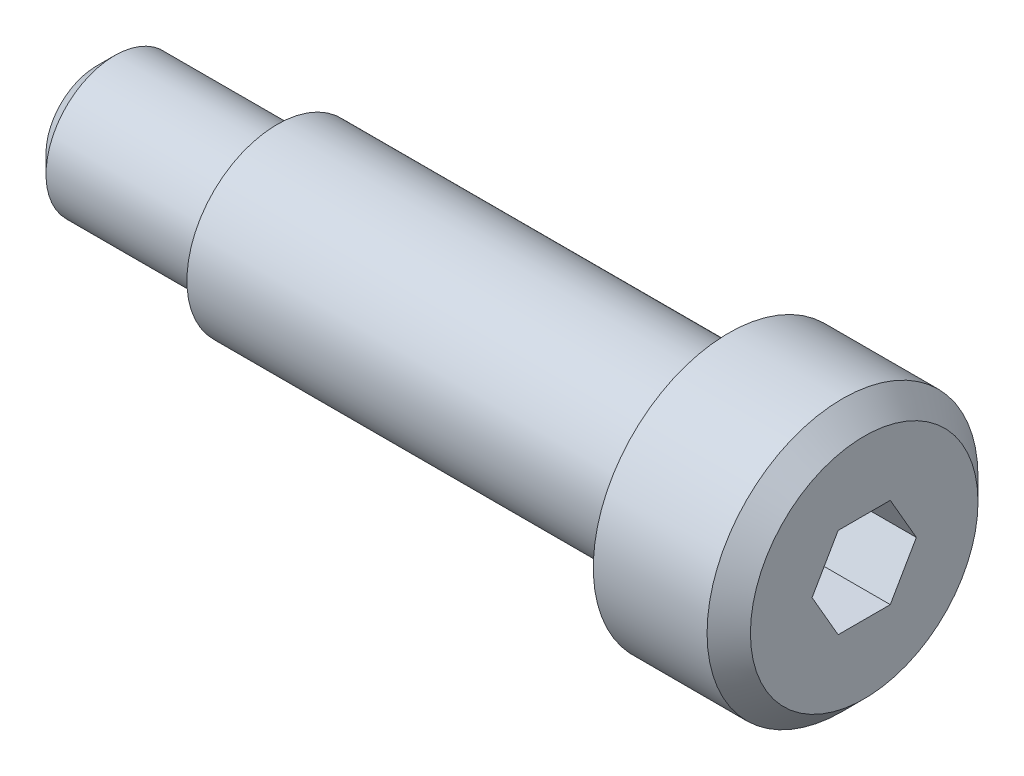
ISO-10303-21;
HEADER;
FILE_DESCRIPTION(('STEP AP214'),'2;1');
FILE_NAME('part.step','',(''),(''),'','','');
FILE_SCHEMA(('AUTOMOTIVE_DESIGN { 1 0 10303 214 1 1 1 1 }'));
ENDSEC;
DATA;
#1=APPLICATION_CONTEXT('core data for automotive mechanical design processes');
#2=APPLICATION_PROTOCOL_DEFINITION('international standard','automotive_design',2000,#1);
#3=PRODUCT_CONTEXT('',#1,'mechanical');
#4=PRODUCT('Part','Part','',(#3));
#5=PRODUCT_RELATED_PRODUCT_CATEGORY('part','',(#4));
#6=PRODUCT_DEFINITION_FORMATION('','',#4);
#7=PRODUCT_DEFINITION_CONTEXT('part definition',#1,'design');
#8=PRODUCT_DEFINITION('design','',#6,#7);
#9=PRODUCT_DEFINITION_SHAPE('','',#8);
#10=(LENGTH_UNIT() NAMED_UNIT(*) SI_UNIT(.MILLI.,.METRE.));
#11=(NAMED_UNIT(*) PLANE_ANGLE_UNIT() SI_UNIT($,.RADIAN.));
#12=(NAMED_UNIT(*) SI_UNIT($,.STERADIAN.) SOLID_ANGLE_UNIT());
#13=UNCERTAINTY_MEASURE_WITH_UNIT(LENGTH_MEASURE(1.E-05),#10,'distance_accuracy_value','');
#14=(GEOMETRIC_REPRESENTATION_CONTEXT(3) GLOBAL_UNCERTAINTY_ASSIGNED_CONTEXT((#13)) GLOBAL_UNIT_ASSIGNED_CONTEXT((#10,
#11,#12)) REPRESENTATION_CONTEXT('',''));
#15=CARTESIAN_POINT('',(0.,0.,0.));
#16=DIRECTION('',(0.,0.,1.));
#17=DIRECTION('',(1.,0.,0.));
#18=AXIS2_PLACEMENT_3D('',#15,#16,#17);
#19=CARTESIAN_POINT('',(-10.723486027,1.268115942,-0.732147081));
#20=DIRECTION('',(0.,1.,0.));
#21=DIRECTION('',(0.,0.,1.));
#22=AXIS2_PLACEMENT_3D('',#19,#20,#21);
#23=PLANE('',#22);
#24=DIRECTION('',(-1.,0.,0.));
#25=VECTOR('',#24,1.);
#26=CARTESIAN_POINT('',(-8.6945005195,1.268115942,0.732147081));
#27=LINE('',#26,#25);
#28=CARTESIAN_POINT('',(-6.665515012,1.268115942543,0.732147080127));
#29=VERTEX_POINT('',#28);
#30=CARTESIAN_POINT('',(-10.723486027,1.268115942,0.732147080875));
#31=VERTEX_POINT('',#30);
#32=EDGE_CURVE('E80',#29,#31,#27,.T.);
#33=ORIENTED_EDGE('',*,*,#32,.T.);
#34=DIRECTION('',(0.,0.,1.));
#35=VECTOR('',#34,1.);
#36=CARTESIAN_POINT('',(-10.723486027,1.268115942,0.));
#37=LINE('',#36,#35);
#38=CARTESIAN_POINT('',(-10.723486027,1.268115942,-0.73214708075));
#39=VERTEX_POINT('',#38);
#40=EDGE_CURVE('E74',#39,#31,#37,.T.);
#41=ORIENTED_EDGE('',*,*,#40,.F.);
#42=DIRECTION('',(1.,0.,0.));
#43=VECTOR('',#42,1.);
#44=CARTESIAN_POINT('',(-8.6945005195,1.268115942,-0.732147081));
#45=LINE('',#44,#43);
#46=CARTESIAN_POINT('',(-6.665515012,1.268115942543,-0.732147080127));
#47=VERTEX_POINT('',#46);
#48=EDGE_CURVE('E110',#39,#47,#45,.T.);
#49=ORIENTED_EDGE('',*,*,#48,.T.);
#50=DIRECTION('',(0.,0.,-1.));
#51=VECTOR('',#50,1.);
#52=CARTESIAN_POINT('',(-6.665515012,1.268115942,0.));
#53=LINE('',#52,#51);
#54=EDGE_CURVE('E115',#29,#47,#53,.T.);
#55=ORIENTED_EDGE('',*,*,#54,.F.);
#56=EDGE_LOOP('',(#33,#41,#49,#55));
#57=FACE_BOUND('',#56,.T.);
#58=ADVANCED_FACE('F16',(#57),#23,.F.);
#59=CARTESIAN_POINT('',(-10.723486027,1.268115942,0.732147081));
#60=DIRECTION('',(0.,0.499999999755502,0.8660254039256));
#61=DIRECTION('',(0.,-0.866025403925599,0.499999999755502));
#62=AXIS2_PLACEMENT_3D('',#59,#60,#61);
#63=PLANE('',#62);
#64=DIRECTION('',(-1.,0.,0.));
#65=VECTOR('',#64,1.);
#66=CARTESIAN_POINT('',(-8.6945005195,0.,1.464294161));
#67=LINE('',#66,#65);
#68=CARTESIAN_POINT('',(-6.665515012,-8.08500022573405E-10,1.46429416065421));
#69=VERTEX_POINT('',#68);
#70=CARTESIAN_POINT('',(-10.723486027,0.,1.464294161));
#71=VERTEX_POINT('',#70);
#72=EDGE_CURVE('E83',#69,#71,#67,.T.);
#73=ORIENTED_EDGE('',*,*,#72,.T.);
#74=DIRECTION('',(0.,-0.8660254039256,0.499999999755502));
#75=VECTOR('',#74,1.);
#76=CARTESIAN_POINT('',(-10.723486027,0.634057971,1.098220621));
#77=LINE('',#76,#75);
#78=EDGE_CURVE('E68',#31,#71,#77,.T.);
#79=ORIENTED_EDGE('',*,*,#78,.F.);
#80=ORIENTED_EDGE('',*,*,#32,.F.);
#81=DIRECTION('',(0.,0.8660254039256,-0.499999999755502));
#82=VECTOR('',#81,1.);
#83=CARTESIAN_POINT('',(-6.665515012,0.634057971,1.098220621));
#84=LINE('',#83,#82);
#85=EDGE_CURVE('E79',#69,#29,#84,.T.);
#86=ORIENTED_EDGE('',*,*,#85,.F.);
#87=EDGE_LOOP('',(#73,#79,#80,#86));
#88=FACE_BOUND('',#87,.T.);
#89=ADVANCED_FACE('F84',(#88),#63,.F.);
#90=CARTESIAN_POINT('',(-10.723486027,0.,-1.464294161));
#91=DIRECTION('',(0.,0.499999999755502,-0.8660254039256));
#92=DIRECTION('',(0.,0.866025403925599,0.499999999755502));
#93=AXIS2_PLACEMENT_3D('',#90,#91,#92);
#94=PLANE('',#93);
#95=ORIENTED_EDGE('',*,*,#48,.F.);
#96=DIRECTION('',(0.,0.866025403777743,0.500000000011598));
#97=VECTOR('',#96,1.);
#98=CARTESIAN_POINT('',(-10.723486027,0.,-1.464294161));
#99=LINE('',#98,#97);
#100=CARTESIAN_POINT('',(-10.723486027,0.,-1.464294161));
#101=VERTEX_POINT('',#100);
#102=EDGE_CURVE('E97',#101,#39,#99,.T.);
#103=ORIENTED_EDGE('',*,*,#102,.F.);
#104=DIRECTION('',(1.,0.,0.));
#105=VECTOR('',#104,1.);
#106=CARTESIAN_POINT('',(-8.6945005195,0.,-1.464294161));
#107=LINE('',#106,#105);
#108=CARTESIAN_POINT('',(-6.665515012,8.08500076783514E-10,-1.46429416065421));
#109=VERTEX_POINT('',#108);
#110=EDGE_CURVE('E126',#101,#109,#107,.T.);
#111=ORIENTED_EDGE('',*,*,#110,.T.);
#112=DIRECTION('',(0.,-0.8660254039256,-0.499999999755502));
#113=VECTOR('',#112,1.);
#114=CARTESIAN_POINT('',(-6.665515012,0.634057971,-1.098220621));
#115=LINE('',#114,#113);
#116=EDGE_CURVE('E90',#47,#109,#115,.T.);
#117=ORIENTED_EDGE('',*,*,#116,.F.);
#118=EDGE_LOOP('',(#95,#103,#111,#117));
#119=FACE_BOUND('',#118,.T.);
#120=ADVANCED_FACE('F205',(#119),#94,.F.);
#121=CARTESIAN_POINT('',(-10.723486027,0.,1.464294161));
#122=DIRECTION('',(0.,-0.499999999755502,0.8660254039256));
#123=DIRECTION('',(0.,-0.866025403925599,-0.499999999755502));
#124=AXIS2_PLACEMENT_3D('',#121,#122,#123);
#125=PLANE('',#124);
#126=DIRECTION('',(-1.,0.,0.));
#127=VECTOR('',#126,1.);
#128=CARTESIAN_POINT('',(-8.6945005195,-1.268115942,0.732147081));
#129=LINE('',#128,#127);
#130=CARTESIAN_POINT('',(-6.665515012,-1.268115942543,0.732147080127));
#131=VERTEX_POINT('',#130);
#132=CARTESIAN_POINT('',(-10.723486027,-1.268115942,0.73214708075));
#133=VERTEX_POINT('',#132);
#134=EDGE_CURVE('E95',#131,#133,#129,.T.);
#135=ORIENTED_EDGE('',*,*,#134,.T.);
#136=DIRECTION('',(0.,-0.866025403777742,-0.500000000011598));
#137=VECTOR('',#136,1.);
#138=CARTESIAN_POINT('',(-10.723486027,0.,1.464294161));
#139=LINE('',#138,#137);
#140=EDGE_CURVE('E20',#71,#133,#139,.T.);
#141=ORIENTED_EDGE('',*,*,#140,.F.);
#142=ORIENTED_EDGE('',*,*,#72,.F.);
#143=DIRECTION('',(0.,0.8660254039256,0.499999999755502));
#144=VECTOR('',#143,1.);
#145=CARTESIAN_POINT('',(-6.665515012,-0.634057971,1.098220621));
#146=LINE('',#145,#144);
#147=EDGE_CURVE('E89',#131,#69,#146,.T.);
#148=ORIENTED_EDGE('',*,*,#147,.F.);
#149=EDGE_LOOP('',(#135,#141,#142,#148));
#150=FACE_BOUND('',#149,.T.);
#151=ADVANCED_FACE('F93',(#150),#125,.F.);
#152=CARTESIAN_POINT('',(-10.723486027,-1.268115942,1.464294161));
#153=DIRECTION('',(1.,0.,0.));
#154=DIRECTION('',(0.,0.,-1.));
#155=AXIS2_PLACEMENT_3D('',#152,#153,#154);
#156=PLANE('',#155);
#157=ORIENTED_EDGE('',*,*,#40,.T.);
#158=ORIENTED_EDGE('',*,*,#78,.T.);
#159=ORIENTED_EDGE('',*,*,#140,.T.);
#160=DIRECTION('',(0.,0.,-1.));
#161=VECTOR('',#160,1.);
#162=CARTESIAN_POINT('',(-10.723486027,-1.268115942,0.));
#163=LINE('',#162,#161);
#164=CARTESIAN_POINT('',(-10.723486027,-1.268115942,-0.73214708075));
#165=VERTEX_POINT('',#164);
#166=EDGE_CURVE('E120',#133,#165,#163,.T.);
#167=ORIENTED_EDGE('',*,*,#166,.T.);
#168=DIRECTION('',(0.,0.8660254039256,-0.499999999755502));
#169=VECTOR('',#168,1.);
#170=CARTESIAN_POINT('',(-10.723486027,-0.634057971,-1.098220621));
#171=LINE('',#170,#169);
#172=EDGE_CURVE('E101',#165,#101,#171,.T.);
#173=ORIENTED_EDGE('',*,*,#172,.T.);
#174=ORIENTED_EDGE('',*,*,#102,.T.);
#175=EDGE_LOOP('',(#157,#158,#159,#167,#173,#174));
#176=FACE_BOUND('',#175,.T.);
#177=ADVANCED_FACE('F70',(#176),#156,.T.);
#178=CARTESIAN_POINT('',(-10.723486027,-1.268115942,-0.732147081));
#179=DIRECTION('',(0.,-0.499999999755502,-0.8660254039256));
#180=DIRECTION('',(0.,0.866025403925599,-0.499999999755502));
#181=AXIS2_PLACEMENT_3D('',#178,#179,#180);
#182=PLANE('',#181);
#183=ORIENTED_EDGE('',*,*,#110,.F.);
#184=ORIENTED_EDGE('',*,*,#172,.F.);
#185=DIRECTION('',(1.,0.,0.));
#186=VECTOR('',#185,1.);
#187=CARTESIAN_POINT('',(-8.6945005195,-1.268115942,-0.732147081));
#188=LINE('',#187,#186);
#189=CARTESIAN_POINT('',(-6.665515012,-1.268115942543,-0.732147080127));
#190=VERTEX_POINT('',#189);
#191=EDGE_CURVE('E122',#165,#190,#188,.T.);
#192=ORIENTED_EDGE('',*,*,#191,.T.);
#193=DIRECTION('',(0.,-0.8660254039256,0.499999999755502));
#194=VECTOR('',#193,1.);
#195=CARTESIAN_POINT('',(-6.665515012,-0.634057971,-1.098220621));
#196=LINE('',#195,#194);
#197=EDGE_CURVE('E36',#109,#190,#196,.T.);
#198=ORIENTED_EDGE('',*,*,#197,.F.);
#199=EDGE_LOOP('',(#183,#184,#192,#198));
#200=FACE_BOUND('',#199,.T.);
#201=ADVANCED_FACE('F213',(#200),#182,.F.);
#202=CARTESIAN_POINT('',(-10.723486027,-1.268115942,0.732147081));
#203=DIRECTION('',(0.,-1.,0.));
#204=DIRECTION('',(0.,0.,-1.));
#205=AXIS2_PLACEMENT_3D('',#202,#203,#204);
#206=PLANE('',#205);
#207=ORIENTED_EDGE('',*,*,#191,.F.);
#208=ORIENTED_EDGE('',*,*,#166,.F.);
#209=ORIENTED_EDGE('',*,*,#134,.F.);
#210=DIRECTION('',(0.,0.,1.));
#211=VECTOR('',#210,1.);
#212=CARTESIAN_POINT('',(-6.665515012,-1.268115944172,0.));
#213=LINE('',#212,#211);
#214=EDGE_CURVE('E154',#190,#131,#213,.T.);
#215=ORIENTED_EDGE('',*,*,#214,.F.);
#216=EDGE_LOOP('',(#207,#208,#209,#215));
#217=FACE_BOUND('',#216,.T.);
#218=ADVANCED_FACE('F216',(#217),#206,.F.);
#219=CARTESIAN_POINT('',(-6.665515012,-3.234,-3.234));
#220=DIRECTION('',(1.,0.,0.));
#221=DIRECTION('',(0.,1.,0.));
#222=AXIS2_PLACEMENT_3D('',#219,#220,#221);
#223=PLANE('',#222);
#224=ORIENTED_EDGE('',*,*,#197,.T.);
#225=ORIENTED_EDGE('',*,*,#214,.T.);
#226=ORIENTED_EDGE('',*,*,#147,.T.);
#227=ORIENTED_EDGE('',*,*,#85,.T.);
#228=ORIENTED_EDGE('',*,*,#54,.T.);
#229=ORIENTED_EDGE('',*,*,#116,.T.);
#230=EDGE_LOOP('',(#224,#225,#226,#227,#228,#229));
#231=FACE_BOUND('',#230,.T.);
#232=CARTESIAN_POINT('',(-6.665515012,0.,0.));
#233=DIRECTION('',(-1.,0.,0.));
#234=DIRECTION('',(0.,0.,1.));
#235=AXIS2_PLACEMENT_3D('',#232,#233,#234);
#236=CIRCLE('',#235,3.195652174);
#237=CARTESIAN_POINT('',(-6.665515012,0.,3.195652174));
#238=VERTEX_POINT('',#237);
#239=EDGE_CURVE('E151',#238,#238,#236,.F.);
#240=ORIENTED_EDGE('',*,*,#239,.T.);
#241=EDGE_LOOP('',(#240));
#242=FACE_BOUND('',#241,.T.);
#243=ADVANCED_FACE('F198',(#231,#242),#223,.T.);
#244=CARTESIAN_POINT('',(-6.665515012,0.,0.));
#245=DIRECTION('',(-1.,0.,0.));
#246=DIRECTION('',(0.,0.,1.));
#247=AXIS2_PLACEMENT_3D('',#244,#245,#246);
#248=CONICAL_SURFACE('',#247,3.195652174,0.785398164218876);
#249=ORIENTED_EDGE('',*,*,#239,.F.);
#250=EDGE_LOOP('',(#249));
#251=FACE_BOUND('',#250,.T.);
#252=CARTESIAN_POINT('',(-7.274210664,0.,0.));
#253=DIRECTION('',(1.,0.,0.));
#254=DIRECTION('',(0.,1.,0.));
#255=AXIS2_PLACEMENT_3D('',#252,#253,#254);
#256=CIRCLE('',#255,3.804347827);
#257=CARTESIAN_POINT('',(-7.274210664,3.804347827,0.));
#258=VERTEX_POINT('',#257);
#259=EDGE_CURVE('E150',#258,#258,#256,.T.);
#260=ORIENTED_EDGE('',*,*,#259,.T.);
#261=EDGE_LOOP('',(#260));
#262=FACE_BOUND('',#261,.T.);
#263=ADVANCED_FACE('F194',(#251,#262),#248,.T.);
#264=CARTESIAN_POINT('',(-10.469862839,0.,0.));
#265=DIRECTION('',(1.,0.,0.));
#266=DIRECTION('',(0.,0.,-1.));
#267=AXIS2_PLACEMENT_3D('',#264,#265,#266);
#268=CYLINDRICAL_SURFACE('',#267,3.804347827);
#269=CARTESIAN_POINT('',(-10.469862839,0.,0.));
#270=DIRECTION('',(1.,0.,0.));
#271=DIRECTION('',(0.,0.,-1.));
#272=AXIS2_PLACEMENT_3D('',#269,#270,#271);
#273=CIRCLE('',#272,3.804347827);
#274=CARTESIAN_POINT('',(-10.469862839,0.,-3.804347827));
#275=VERTEX_POINT('',#274);
#276=EDGE_CURVE('E146',#275,#275,#273,.F.);
#277=ORIENTED_EDGE('',*,*,#276,.F.);
#278=EDGE_LOOP('',(#277));
#279=FACE_BOUND('',#278,.T.);
#280=ORIENTED_EDGE('',*,*,#259,.F.);
#281=EDGE_LOOP('',(#280));
#282=FACE_BOUND('',#281,.T.);
#283=ADVANCED_FACE('F191',(#279,#282),#268,.T.);
#284=CARTESIAN_POINT('',(-10.469862839,3.850000001,-3.850000001));
#285=DIRECTION('',(-1.,0.,0.));
#286=DIRECTION('',(0.,-1.,0.));
#287=AXIS2_PLACEMENT_3D('',#284,#285,#286);
#288=PLANE('',#287);
#289=CARTESIAN_POINT('',(-10.469862839,0.,0.));
#290=DIRECTION('',(1.,0.,0.));
#291=DIRECTION('',(0.,0.,-1.));
#292=AXIS2_PLACEMENT_3D('',#289,#290,#291);
#293=CIRCLE('',#292,2.536231885);
#294=CARTESIAN_POINT('',(-10.469862839,0.,-2.536231885));
#295=VERTEX_POINT('',#294);
#296=EDGE_CURVE('E142',#295,#295,#293,.T.);
#297=ORIENTED_EDGE('',*,*,#296,.T.);
#298=EDGE_LOOP('',(#297));
#299=FACE_BOUND('',#298,.T.);
#300=ORIENTED_EDGE('',*,*,#276,.T.);
#301=EDGE_LOOP('',(#300));
#302=FACE_BOUND('',#301,.T.);
#303=ADVANCED_FACE('F189',(#299,#302),#288,.T.);
#304=CARTESIAN_POINT('',(-23.151022262,0.,0.));
#305=DIRECTION('',(1.,0.,0.));
#306=DIRECTION('',(0.,0.,-1.));
#307=AXIS2_PLACEMENT_3D('',#304,#305,#306);
#308=CYLINDRICAL_SURFACE('',#307,2.536231885);
#309=ORIENTED_EDGE('',*,*,#296,.F.);
#310=EDGE_LOOP('',(#309));
#311=FACE_BOUND('',#310,.T.);
#312=CARTESIAN_POINT('',(-23.151022262,0.,0.));
#313=DIRECTION('',(1.,0.,0.));
#314=DIRECTION('',(0.,0.,-1.));
#315=AXIS2_PLACEMENT_3D('',#312,#313,#314);
#316=CIRCLE('',#315,2.536231885);
#317=CARTESIAN_POINT('',(-23.151022262,0.,-2.536231885));
#318=VERTEX_POINT('',#317);
#319=EDGE_CURVE('E139',#318,#318,#316,.F.);
#320=ORIENTED_EDGE('',*,*,#319,.F.);
#321=EDGE_LOOP('',(#320));
#322=FACE_BOUND('',#321,.T.);
#323=ADVANCED_FACE('F186',(#311,#322),#308,.T.);
#324=CARTESIAN_POINT('',(-23.151022262,2.566666667,-2.566666667));
#325=DIRECTION('',(-1.,0.,0.));
#326=DIRECTION('',(0.,-1.,0.));
#327=AXIS2_PLACEMENT_3D('',#324,#325,#326);
#328=PLANE('',#327);
#329=CARTESIAN_POINT('',(-23.151022262,0.,0.));
#330=DIRECTION('',(1.,0.,0.));
#331=DIRECTION('',(0.,0.,-1.));
#332=AXIS2_PLACEMENT_3D('',#329,#330,#331);
#333=CIRCLE('',#332,1.927536232);
#334=CARTESIAN_POINT('',(-23.151022262,0.,-1.927536232));
#335=VERTEX_POINT('',#334);
#336=EDGE_CURVE('E135',#335,#335,#333,.T.);
#337=ORIENTED_EDGE('',*,*,#336,.T.);
#338=EDGE_LOOP('',(#337));
#339=FACE_BOUND('',#338,.T.);
#340=ORIENTED_EDGE('',*,*,#319,.T.);
#341=EDGE_LOOP('',(#340));
#342=FACE_BOUND('',#341,.T.);
#343=ADVANCED_FACE('F184',(#339,#342),#328,.T.);
#344=CARTESIAN_POINT('',(-27.716239655,0.,0.));
#345=DIRECTION('',(1.,0.,0.));
#346=DIRECTION('',(0.,0.,-1.));
#347=AXIS2_PLACEMENT_3D('',#344,#345,#346);
#348=CYLINDRICAL_SURFACE('',#347,1.927536232);
#349=ORIENTED_EDGE('',*,*,#336,.F.);
#350=EDGE_LOOP('',(#349));
#351=FACE_BOUND('',#350,.T.);
#352=CARTESIAN_POINT('',(-27.7162396549999,0.,0.));
#353=DIRECTION('',(1.,0.,0.));
#354=DIRECTION('',(0.,1.,0.));
#355=AXIS2_PLACEMENT_3D('',#352,#353,#354);
#356=CIRCLE('',#355,1.927536232);
#357=CARTESIAN_POINT('',(-27.716239655,1.927536232,0.));
#358=VERTEX_POINT('',#357);
#359=EDGE_CURVE('E27',#358,#358,#356,.T.);
#360=ORIENTED_EDGE('',*,*,#359,.T.);
#361=EDGE_LOOP('',(#360));
#362=FACE_BOUND('',#361,.T.);
#363=ADVANCED_FACE('F169',(#351,#362),#348,.T.);
#364=CARTESIAN_POINT('',(-28.223486031,1.437333333,-1.437333333));
#365=DIRECTION('',(-1.,0.,0.));
#366=DIRECTION('',(0.,-1.,0.));
#367=AXIS2_PLACEMENT_3D('',#364,#365,#366);
#368=PLANE('',#367);
#369=CARTESIAN_POINT('',(-28.223486031,0.,0.));
#370=DIRECTION('',(1.,0.,0.));
#371=DIRECTION('',(0.,0.,-1.));
#372=AXIS2_PLACEMENT_3D('',#369,#370,#371);
#373=CIRCLE('',#372,1.420289855);
#374=CARTESIAN_POINT('',(-28.223486031,0.,-1.420289855));
#375=VERTEX_POINT('',#374);
#376=EDGE_CURVE('E11',#375,#375,#373,.F.);
#377=ORIENTED_EDGE('',*,*,#376,.T.);
#378=EDGE_LOOP('',(#377));
#379=FACE_BOUND('',#378,.T.);
#380=ADVANCED_FACE('F18',(#379),#368,.T.);
#381=CARTESIAN_POINT('',(-28.223486031,0.,0.));
#382=DIRECTION('',(1.,0.,0.));
#383=DIRECTION('',(0.,0.,-1.));
#384=AXIS2_PLACEMENT_3D('',#381,#382,#383);
#385=CONICAL_SURFACE('',#384,1.420289855,0.785398164383165);
#386=ORIENTED_EDGE('',*,*,#376,.F.);
#387=EDGE_LOOP('',(#386));
#388=FACE_BOUND('',#387,.T.);
#389=ORIENTED_EDGE('',*,*,#359,.F.);
#390=EDGE_LOOP('',(#389));
#391=FACE_BOUND('',#390,.T.);
#392=ADVANCED_FACE('F171',(#388,#391),#385,.T.);
#393=CLOSED_SHELL('',(#58,#89,#120,#151,#177,#201,#218,#243,#263,#283,#303,#323,#343,#363,#380,#392));
#394=MANIFOLD_SOLID_BREP('B1',#393);
#395=ADVANCED_BREP_SHAPE_REPRESENTATION('',(#18,#394),#14);
#396=SHAPE_DEFINITION_REPRESENTATION(#9,#395);
ENDSEC;
END-ISO-10303-21;
